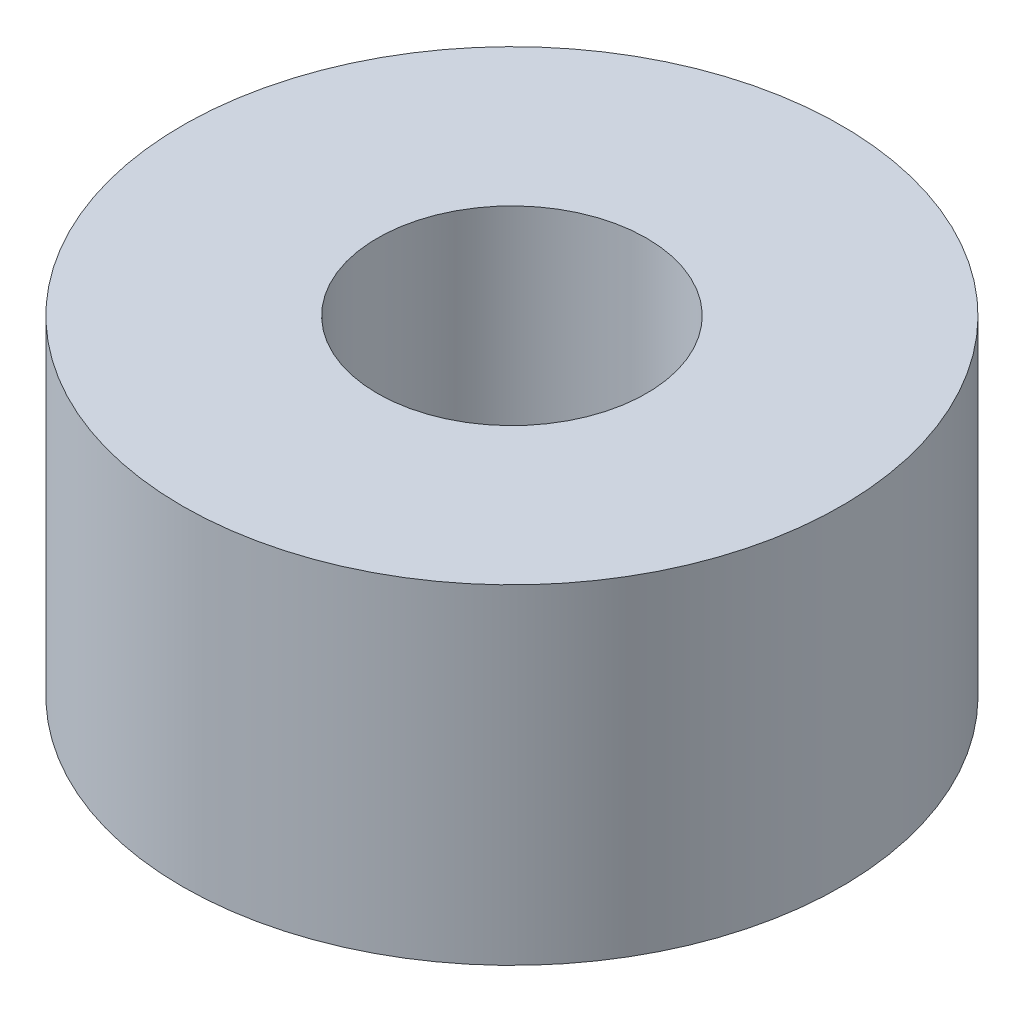
ISO-10303-21;
HEADER;
FILE_DESCRIPTION(('STEP AP214'),'2;1');
FILE_NAME('part.step','',(''),(''),'','','');
FILE_SCHEMA(('AUTOMOTIVE_DESIGN { 1 0 10303 214 1 1 1 1 }'));
ENDSEC;
DATA;
#1=APPLICATION_CONTEXT('core data for automotive mechanical design processes');
#2=APPLICATION_PROTOCOL_DEFINITION('international standard','automotive_design',2000,#1);
#3=PRODUCT_CONTEXT('',#1,'mechanical');
#4=PRODUCT('Part','Part','',(#3));
#5=PRODUCT_RELATED_PRODUCT_CATEGORY('part','',(#4));
#6=PRODUCT_DEFINITION_FORMATION('','',#4);
#7=PRODUCT_DEFINITION_CONTEXT('part definition',#1,'design');
#8=PRODUCT_DEFINITION('design','',#6,#7);
#9=PRODUCT_DEFINITION_SHAPE('','',#8);
#10=(LENGTH_UNIT() NAMED_UNIT(*) SI_UNIT(.MILLI.,.METRE.));
#11=(NAMED_UNIT(*) PLANE_ANGLE_UNIT() SI_UNIT($,.RADIAN.));
#12=(NAMED_UNIT(*) SI_UNIT($,.STERADIAN.) SOLID_ANGLE_UNIT());
#13=UNCERTAINTY_MEASURE_WITH_UNIT(LENGTH_MEASURE(1.E-05),#10,'distance_accuracy_value','');
#14=(GEOMETRIC_REPRESENTATION_CONTEXT(3) GLOBAL_UNCERTAINTY_ASSIGNED_CONTEXT((#13)) GLOBAL_UNIT_ASSIGNED_CONTEXT((#10,
#11,#12)) REPRESENTATION_CONTEXT('',''));
#15=CARTESIAN_POINT('',(0.,0.,0.));
#16=DIRECTION('',(0.,0.,1.));
#17=DIRECTION('',(1.,0.,0.));
#18=AXIS2_PLACEMENT_3D('',#15,#16,#17);
#19=CARTESIAN_POINT('',(20.,3.,-4.95013043166266));
#20=DIRECTION('',(0.,-1.,0.));
#21=DIRECTION('',(0.,0.,-1.));
#22=AXIS2_PLACEMENT_3D('',#19,#20,#21);
#23=CYLINDRICAL_SURFACE('',#22,1.225);
#24=CARTESIAN_POINT('',(20.,3.,-4.95013043166266));
#25=DIRECTION('',(0.,1.,0.));
#26=DIRECTION('',(0.,0.,1.));
#27=AXIS2_PLACEMENT_3D('',#24,#25,#26);
#28=CIRCLE('',#27,1.225);
#29=CARTESIAN_POINT('',(20.,3.,-3.72513043166266));
#30=VERTEX_POINT('',#29);
#31=EDGE_CURVE('E38',#30,#30,#28,.T.);
#32=ORIENTED_EDGE('',*,*,#31,.T.);
#33=EDGE_LOOP('',(#32));
#34=FACE_BOUND('',#33,.T.);
#35=CARTESIAN_POINT('',(20.,0.,-4.95013043166266));
#36=DIRECTION('',(0.,1.,0.));
#37=DIRECTION('',(0.,0.,1.));
#38=AXIS2_PLACEMENT_3D('',#35,#36,#37);
#39=CIRCLE('',#38,1.225);
#40=CARTESIAN_POINT('',(20.,0.,-3.72513043166266));
#41=VERTEX_POINT('',#40);
#42=EDGE_CURVE('E44',#41,#41,#39,.T.);
#43=ORIENTED_EDGE('',*,*,#42,.F.);
#44=EDGE_LOOP('',(#43));
#45=FACE_BOUND('',#44,.T.);
#46=ADVANCED_FACE('F31',(#34,#45),#23,.F.);
#47=CARTESIAN_POINT('',(20.,3.,-4.95013043166266));
#48=DIRECTION('',(0.,-1.,0.));
#49=DIRECTION('',(0.,0.,-1.));
#50=AXIS2_PLACEMENT_3D('',#47,#48,#49);
#51=CYLINDRICAL_SURFACE('',#50,3.);
#52=CARTESIAN_POINT('',(20.,3.,-4.95013043166266));
#53=DIRECTION('',(0.,1.,0.));
#54=DIRECTION('',(0.,0.,1.));
#55=AXIS2_PLACEMENT_3D('',#52,#53,#54);
#56=CIRCLE('',#55,3.);
#57=CARTESIAN_POINT('',(20.,3.,-1.95013043166266));
#58=VERTEX_POINT('',#57);
#59=EDGE_CURVE('E10',#58,#58,#56,.T.);
#60=ORIENTED_EDGE('',*,*,#59,.F.);
#61=EDGE_LOOP('',(#60));
#62=FACE_BOUND('',#61,.T.);
#63=CARTESIAN_POINT('',(20.,0.,-4.95013043166266));
#64=DIRECTION('',(0.,1.,0.));
#65=DIRECTION('',(0.,0.,1.));
#66=AXIS2_PLACEMENT_3D('',#63,#64,#65);
#67=CIRCLE('',#66,3.);
#68=CARTESIAN_POINT('',(20.,0.,-1.95013043166266));
#69=VERTEX_POINT('',#68);
#70=EDGE_CURVE('E34',#69,#69,#67,.T.);
#71=ORIENTED_EDGE('',*,*,#70,.T.);
#72=EDGE_LOOP('',(#71));
#73=FACE_BOUND('',#72,.T.);
#74=ADVANCED_FACE('F51',(#62,#73),#51,.T.);
#75=CARTESIAN_POINT('',(0.,3.,0.));
#76=DIRECTION('',(0.,1.,0.));
#77=DIRECTION('',(0.,0.,1.));
#78=AXIS2_PLACEMENT_3D('',#75,#76,#77);
#79=PLANE('',#78);
#80=ORIENTED_EDGE('',*,*,#31,.F.);
#81=EDGE_LOOP('',(#80));
#82=FACE_BOUND('',#81,.T.);
#83=ORIENTED_EDGE('',*,*,#59,.T.);
#84=EDGE_LOOP('',(#83));
#85=FACE_BOUND('',#84,.T.);
#86=ADVANCED_FACE('F55',(#82,#85),#79,.T.);
#87=CARTESIAN_POINT('',(0.,0.,0.));
#88=DIRECTION('',(0.,1.,0.));
#89=DIRECTION('',(0.,0.,1.));
#90=AXIS2_PLACEMENT_3D('',#87,#88,#89);
#91=PLANE('',#90);
#92=ORIENTED_EDGE('',*,*,#42,.T.);
#93=EDGE_LOOP('',(#92));
#94=FACE_BOUND('',#93,.T.);
#95=ORIENTED_EDGE('',*,*,#70,.F.);
#96=EDGE_LOOP('',(#95));
#97=FACE_BOUND('',#96,.T.);
#98=ADVANCED_FACE('F53',(#94,#97),#91,.F.);
#99=CLOSED_SHELL('',(#46,#74,#86,#98));
#100=MANIFOLD_SOLID_BREP('B2',#99);
#101=ADVANCED_BREP_SHAPE_REPRESENTATION('',(#18,#100),#14);
#102=SHAPE_DEFINITION_REPRESENTATION(#9,#101);
ENDSEC;
END-ISO-10303-21;
